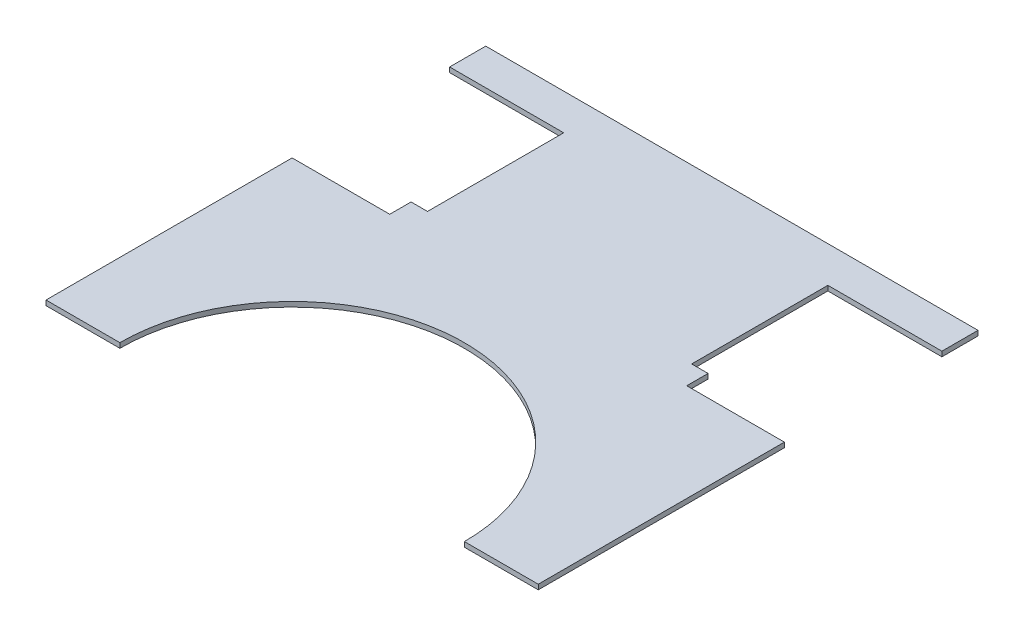
ISO-10303-21;
HEADER;
FILE_DESCRIPTION(('STEP AP214'),'2;1');
FILE_NAME('part.step','',(''),(''),'','','');
FILE_SCHEMA(('AUTOMOTIVE_DESIGN { 1 0 10303 214 1 1 1 1 }'));
ENDSEC;
DATA;
#1=APPLICATION_CONTEXT('core data for automotive mechanical design processes');
#2=APPLICATION_PROTOCOL_DEFINITION('international standard','automotive_design',2000,#1);
#3=PRODUCT_CONTEXT('',#1,'mechanical');
#4=PRODUCT('Part','Part','',(#3));
#5=PRODUCT_RELATED_PRODUCT_CATEGORY('part','',(#4));
#6=PRODUCT_DEFINITION_FORMATION('','',#4);
#7=PRODUCT_DEFINITION_CONTEXT('part definition',#1,'design');
#8=PRODUCT_DEFINITION('design','',#6,#7);
#9=PRODUCT_DEFINITION_SHAPE('','',#8);
#10=(LENGTH_UNIT() NAMED_UNIT(*) SI_UNIT(.MILLI.,.METRE.));
#11=(NAMED_UNIT(*) PLANE_ANGLE_UNIT() SI_UNIT($,.RADIAN.));
#12=(NAMED_UNIT(*) SI_UNIT($,.STERADIAN.) SOLID_ANGLE_UNIT());
#13=UNCERTAINTY_MEASURE_WITH_UNIT(LENGTH_MEASURE(1.E-05),#10,'distance_accuracy_value','');
#14=(GEOMETRIC_REPRESENTATION_CONTEXT(3) GLOBAL_UNCERTAINTY_ASSIGNED_CONTEXT((#13)) GLOBAL_UNIT_ASSIGNED_CONTEXT((#10,
#11,#12)) REPRESENTATION_CONTEXT('',''));
#15=CARTESIAN_POINT('',(0.,0.,0.));
#16=DIRECTION('',(0.,0.,1.));
#17=DIRECTION('',(1.,0.,0.));
#18=AXIS2_PLACEMENT_3D('',#15,#16,#17);
#19=CARTESIAN_POINT('',(-150.,3.,0.));
#20=DIRECTION('',(1.,0.,0.));
#21=DIRECTION('',(0.,0.,-1.));
#22=AXIS2_PLACEMENT_3D('',#19,#20,#21);
#23=PLANE('',#22);
#24=DIRECTION('',(0.,0.,1.));
#25=VECTOR('',#24,1.);
#26=CARTESIAN_POINT('',(-150.,0.,0.));
#27=LINE('',#26,#25);
#28=CARTESIAN_POINT('',(-150.,0.,0.));
#29=VERTEX_POINT('',#28);
#30=CARTESIAN_POINT('',(-150.,0.,22.));
#31=VERTEX_POINT('',#30);
#32=EDGE_CURVE('E187',#29,#31,#27,.T.);
#33=ORIENTED_EDGE('',*,*,#32,.T.);
#34=DIRECTION('',(0.,-1.,0.));
#35=VECTOR('',#34,1.);
#36=CARTESIAN_POINT('',(-150.,3.,22.));
#37=LINE('',#36,#35);
#38=CARTESIAN_POINT('',(-150.,3.,22.));
#39=VERTEX_POINT('',#38);
#40=EDGE_CURVE('E11',#39,#31,#37,.T.);
#41=ORIENTED_EDGE('',*,*,#40,.F.);
#42=DIRECTION('',(0.,0.,1.));
#43=VECTOR('',#42,1.);
#44=CARTESIAN_POINT('',(-150.,3.,0.));
#45=LINE('',#44,#43);
#46=CARTESIAN_POINT('',(-150.,3.,0.));
#47=VERTEX_POINT('',#46);
#48=EDGE_CURVE('E221',#47,#39,#45,.T.);
#49=ORIENTED_EDGE('',*,*,#48,.F.);
#50=DIRECTION('',(0.,-1.,0.));
#51=VECTOR('',#50,1.);
#52=CARTESIAN_POINT('',(-150.,3.,0.));
#53=LINE('',#52,#51);
#54=EDGE_CURVE('E183',#47,#29,#53,.T.);
#55=ORIENTED_EDGE('',*,*,#54,.T.);
#56=EDGE_LOOP('',(#33,#41,#49,#55));
#57=FACE_BOUND('',#56,.T.);
#58=ADVANCED_FACE('F31',(#57),#23,.F.);
#59=CARTESIAN_POINT('',(-150.,3.,22.));
#60=DIRECTION('',(0.,0.,-1.));
#61=DIRECTION('',(-1.,0.,0.));
#62=AXIS2_PLACEMENT_3D('',#59,#60,#61);
#63=PLANE('',#62);
#64=DIRECTION('',(1.,0.,0.));
#65=VECTOR('',#64,1.);
#66=CARTESIAN_POINT('',(-150.,0.,22.));
#67=LINE('',#66,#65);
#68=CARTESIAN_POINT('',(-80.5,0.,22.));
#69=VERTEX_POINT('',#68);
#70=EDGE_CURVE('E190',#31,#69,#67,.T.);
#71=ORIENTED_EDGE('',*,*,#70,.T.);
#72=DIRECTION('',(0.,-1.,0.));
#73=VECTOR('',#72,1.);
#74=CARTESIAN_POINT('',(-80.5,3.,22.));
#75=LINE('',#74,#73);
#76=CARTESIAN_POINT('',(-80.5,3.,22.));
#77=VERTEX_POINT('',#76);
#78=EDGE_CURVE('E39',#77,#69,#75,.T.);
#79=ORIENTED_EDGE('',*,*,#78,.F.);
#80=DIRECTION('',(1.,0.,0.));
#81=VECTOR('',#80,1.);
#82=CARTESIAN_POINT('',(-150.,3.,22.));
#83=LINE('',#82,#81);
#84=EDGE_CURVE('E120',#39,#77,#83,.T.);
#85=ORIENTED_EDGE('',*,*,#84,.F.);
#86=ORIENTED_EDGE('',*,*,#40,.T.);
#87=EDGE_LOOP('',(#71,#79,#85,#86));
#88=FACE_BOUND('',#87,.T.);
#89=ADVANCED_FACE('F329',(#88),#63,.F.);
#90=CARTESIAN_POINT('',(-80.5,3.,22.));
#91=DIRECTION('',(1.,0.,0.));
#92=DIRECTION('',(0.,0.,-1.));
#93=AXIS2_PLACEMENT_3D('',#90,#91,#92);
#94=PLANE('',#93);
#95=DIRECTION('',(0.,0.,1.));
#96=VECTOR('',#95,1.);
#97=CARTESIAN_POINT('',(-80.5,0.,22.));
#98=LINE('',#97,#96);
#99=CARTESIAN_POINT('',(-80.5,0.,105.));
#100=VERTEX_POINT('',#99);
#101=EDGE_CURVE('E192',#69,#100,#98,.T.);
#102=ORIENTED_EDGE('',*,*,#101,.T.);
#103=DIRECTION('',(0.,-1.,0.));
#104=VECTOR('',#103,1.);
#105=CARTESIAN_POINT('',(-80.5,3.,105.));
#106=LINE('',#105,#104);
#107=CARTESIAN_POINT('',(-80.5,3.,105.));
#108=VERTEX_POINT('',#107);
#109=EDGE_CURVE('E258',#108,#100,#106,.T.);
#110=ORIENTED_EDGE('',*,*,#109,.F.);
#111=DIRECTION('',(0.,0.,1.));
#112=VECTOR('',#111,1.);
#113=CARTESIAN_POINT('',(-80.5,3.,22.));
#114=LINE('',#113,#112);
#115=EDGE_CURVE('E266',#77,#108,#114,.T.);
#116=ORIENTED_EDGE('',*,*,#115,.F.);
#117=ORIENTED_EDGE('',*,*,#78,.T.);
#118=EDGE_LOOP('',(#102,#110,#116,#117));
#119=FACE_BOUND('',#118,.T.);
#120=ADVANCED_FACE('F264',(#119),#94,.F.);
#121=CARTESIAN_POINT('',(-80.5,3.,105.));
#122=DIRECTION('',(0.,0.,1.));
#123=DIRECTION('',(1.,0.,0.));
#124=AXIS2_PLACEMENT_3D('',#121,#122,#123);
#125=PLANE('',#124);
#126=DIRECTION('',(-1.,0.,0.));
#127=VECTOR('',#126,1.);
#128=CARTESIAN_POINT('',(-80.5,0.,105.));
#129=LINE('',#128,#127);
#130=CARTESIAN_POINT('',(-90.5,0.,105.));
#131=VERTEX_POINT('',#130);
#132=EDGE_CURVE('E194',#100,#131,#129,.T.);
#133=ORIENTED_EDGE('',*,*,#132,.T.);
#134=DIRECTION('',(0.,-1.,0.));
#135=VECTOR('',#134,1.);
#136=CARTESIAN_POINT('',(-90.5,3.,105.));
#137=LINE('',#136,#135);
#138=CARTESIAN_POINT('',(-90.5,3.,105.));
#139=VERTEX_POINT('',#138);
#140=EDGE_CURVE('E255',#139,#131,#137,.T.);
#141=ORIENTED_EDGE('',*,*,#140,.F.);
#142=DIRECTION('',(-1.,0.,0.));
#143=VECTOR('',#142,1.);
#144=CARTESIAN_POINT('',(-80.5,3.,105.));
#145=LINE('',#144,#143);
#146=EDGE_CURVE('E284',#108,#139,#145,.T.);
#147=ORIENTED_EDGE('',*,*,#146,.F.);
#148=ORIENTED_EDGE('',*,*,#109,.T.);
#149=EDGE_LOOP('',(#133,#141,#147,#148));
#150=FACE_BOUND('',#149,.T.);
#151=ADVANCED_FACE('F275',(#150),#125,.F.);
#152=CARTESIAN_POINT('',(-90.5,3.,105.));
#153=DIRECTION('',(1.,0.,0.));
#154=DIRECTION('',(0.,0.,-1.));
#155=AXIS2_PLACEMENT_3D('',#152,#153,#154);
#156=PLANE('',#155);
#157=DIRECTION('',(0.,0.,1.));
#158=VECTOR('',#157,1.);
#159=CARTESIAN_POINT('',(-90.5,0.,105.));
#160=LINE('',#159,#158);
#161=CARTESIAN_POINT('',(-90.5,0.,118.));
#162=VERTEX_POINT('',#161);
#163=EDGE_CURVE('E196',#131,#162,#160,.T.);
#164=ORIENTED_EDGE('',*,*,#163,.T.);
#165=DIRECTION('',(0.,-1.,0.));
#166=VECTOR('',#165,1.);
#167=CARTESIAN_POINT('',(-90.5,3.,118.));
#168=LINE('',#167,#166);
#169=CARTESIAN_POINT('',(-90.5,3.,118.));
#170=VERTEX_POINT('',#169);
#171=EDGE_CURVE('E252',#170,#162,#168,.T.);
#172=ORIENTED_EDGE('',*,*,#171,.F.);
#173=DIRECTION('',(0.,0.,1.));
#174=VECTOR('',#173,1.);
#175=CARTESIAN_POINT('',(-90.5,3.,105.));
#176=LINE('',#175,#174);
#177=EDGE_CURVE('E281',#139,#170,#176,.T.);
#178=ORIENTED_EDGE('',*,*,#177,.F.);
#179=ORIENTED_EDGE('',*,*,#140,.T.);
#180=EDGE_LOOP('',(#164,#172,#178,#179));
#181=FACE_BOUND('',#180,.T.);
#182=ADVANCED_FACE('F279',(#181),#156,.F.);
#183=CARTESIAN_POINT('',(-90.5,3.,118.));
#184=DIRECTION('',(0.,0.,1.));
#185=DIRECTION('',(1.,0.,0.));
#186=AXIS2_PLACEMENT_3D('',#183,#184,#185);
#187=PLANE('',#186);
#188=DIRECTION('',(-1.,0.,0.));
#189=VECTOR('',#188,1.);
#190=CARTESIAN_POINT('',(-90.5,0.,118.));
#191=LINE('',#190,#189);
#192=CARTESIAN_POINT('',(-150.,0.,118.));
#193=VERTEX_POINT('',#192);
#194=EDGE_CURVE('E198',#162,#193,#191,.T.);
#195=ORIENTED_EDGE('',*,*,#194,.T.);
#196=DIRECTION('',(0.,-1.,0.));
#197=VECTOR('',#196,1.);
#198=CARTESIAN_POINT('',(-150.,3.,118.));
#199=LINE('',#198,#197);
#200=CARTESIAN_POINT('',(-150.,3.,118.));
#201=VERTEX_POINT('',#200);
#202=EDGE_CURVE('E249',#201,#193,#199,.T.);
#203=ORIENTED_EDGE('',*,*,#202,.F.);
#204=DIRECTION('',(-1.,0.,0.));
#205=VECTOR('',#204,1.);
#206=CARTESIAN_POINT('',(-90.5,3.,118.));
#207=LINE('',#206,#205);
#208=EDGE_CURVE('E283',#170,#201,#207,.T.);
#209=ORIENTED_EDGE('',*,*,#208,.F.);
#210=ORIENTED_EDGE('',*,*,#171,.T.);
#211=EDGE_LOOP('',(#195,#203,#209,#210));
#212=FACE_BOUND('',#211,.T.);
#213=ADVANCED_FACE('F342',(#212),#187,.F.);
#214=CARTESIAN_POINT('',(-150.,3.,118.));
#215=DIRECTION('',(1.,0.,0.));
#216=DIRECTION('',(0.,0.,-1.));
#217=AXIS2_PLACEMENT_3D('',#214,#215,#216);
#218=PLANE('',#217);
#219=DIRECTION('',(0.,0.,1.));
#220=VECTOR('',#219,1.);
#221=CARTESIAN_POINT('',(-150.,0.,118.));
#222=LINE('',#221,#220);
#223=CARTESIAN_POINT('',(-150.,0.,268.));
#224=VERTEX_POINT('',#223);
#225=EDGE_CURVE('E200',#193,#224,#222,.T.);
#226=ORIENTED_EDGE('',*,*,#225,.T.);
#227=DIRECTION('',(0.,-1.,0.));
#228=VECTOR('',#227,1.);
#229=CARTESIAN_POINT('',(-150.,3.,268.));
#230=LINE('',#229,#228);
#231=CARTESIAN_POINT('',(-150.,3.,268.));
#232=VERTEX_POINT('',#231);
#233=EDGE_CURVE('E246',#232,#224,#230,.T.);
#234=ORIENTED_EDGE('',*,*,#233,.F.);
#235=DIRECTION('',(0.,0.,1.));
#236=VECTOR('',#235,1.);
#237=CARTESIAN_POINT('',(-150.,3.,118.));
#238=LINE('',#237,#236);
#239=EDGE_CURVE('E286',#201,#232,#238,.T.);
#240=ORIENTED_EDGE('',*,*,#239,.F.);
#241=ORIENTED_EDGE('',*,*,#202,.T.);
#242=EDGE_LOOP('',(#226,#234,#240,#241));
#243=FACE_BOUND('',#242,.T.);
#244=ADVANCED_FACE('F345',(#243),#218,.F.);
#245=CARTESIAN_POINT('',(-150.,3.,268.));
#246=DIRECTION('',(0.,0.,-1.));
#247=DIRECTION('',(-1.,0.,0.));
#248=AXIS2_PLACEMENT_3D('',#245,#246,#247);
#249=PLANE('',#248);
#250=DIRECTION('',(1.,0.,0.));
#251=VECTOR('',#250,1.);
#252=CARTESIAN_POINT('',(-150.,0.,268.));
#253=LINE('',#252,#251);
#254=CARTESIAN_POINT('',(-105.,0.,268.));
#255=VERTEX_POINT('',#254);
#256=EDGE_CURVE('E202',#224,#255,#253,.T.);
#257=ORIENTED_EDGE('',*,*,#256,.T.);
#258=DIRECTION('',(0.,-1.,0.));
#259=VECTOR('',#258,1.);
#260=CARTESIAN_POINT('',(-105.,3.,268.));
#261=LINE('',#260,#259);
#262=CARTESIAN_POINT('',(-105.,3.,268.));
#263=VERTEX_POINT('',#262);
#264=EDGE_CURVE('E243',#263,#255,#261,.T.);
#265=ORIENTED_EDGE('',*,*,#264,.F.);
#266=DIRECTION('',(1.,0.,0.));
#267=VECTOR('',#266,1.);
#268=CARTESIAN_POINT('',(-150.,3.,268.));
#269=LINE('',#268,#267);
#270=EDGE_CURVE('E292',#232,#263,#269,.T.);
#271=ORIENTED_EDGE('',*,*,#270,.F.);
#272=ORIENTED_EDGE('',*,*,#233,.T.);
#273=EDGE_LOOP('',(#257,#265,#271,#272));
#274=FACE_BOUND('',#273,.T.);
#275=ADVANCED_FACE('F349',(#274),#249,.F.);
#276=CARTESIAN_POINT('',(0.,3.,268.));
#277=DIRECTION('',(0.,-1.,0.));
#278=DIRECTION('',(0.,0.,-1.));
#279=AXIS2_PLACEMENT_3D('',#276,#277,#278);
#280=CYLINDRICAL_SURFACE('',#279,105.);
#281=CARTESIAN_POINT('',(0.,0.,268.));
#282=DIRECTION('',(0.,-1.,0.));
#283=DIRECTION('',(0.,0.,-1.));
#284=AXIS2_PLACEMENT_3D('',#281,#282,#283);
#285=CIRCLE('',#284,105.);
#286=CARTESIAN_POINT('',(105.,0.,268.));
#287=VERTEX_POINT('',#286);
#288=EDGE_CURVE('E204',#255,#287,#285,.T.);
#289=ORIENTED_EDGE('',*,*,#288,.T.);
#290=DIRECTION('',(0.,-1.,0.));
#291=VECTOR('',#290,1.);
#292=CARTESIAN_POINT('',(105.,3.,268.));
#293=LINE('',#292,#291);
#294=CARTESIAN_POINT('',(105.,3.,268.));
#295=VERTEX_POINT('',#294);
#296=EDGE_CURVE('E240',#295,#287,#293,.T.);
#297=ORIENTED_EDGE('',*,*,#296,.F.);
#298=CARTESIAN_POINT('',(0.,3.,268.));
#299=DIRECTION('',(0.,-1.,0.));
#300=DIRECTION('',(0.,0.,-1.));
#301=AXIS2_PLACEMENT_3D('',#298,#299,#300);
#302=CIRCLE('',#301,105.);
#303=EDGE_CURVE('E294',#263,#295,#302,.T.);
#304=ORIENTED_EDGE('',*,*,#303,.F.);
#305=ORIENTED_EDGE('',*,*,#264,.T.);
#306=EDGE_LOOP('',(#289,#297,#304,#305));
#307=FACE_BOUND('',#306,.T.);
#308=ADVANCED_FACE('F353',(#307),#280,.F.);
#309=CARTESIAN_POINT('',(150.,3.,268.));
#310=DIRECTION('',(0.,0.,-1.));
#311=DIRECTION('',(-1.,0.,0.));
#312=AXIS2_PLACEMENT_3D('',#309,#310,#311);
#313=PLANE('',#312);
#314=DIRECTION('',(1.,0.,0.));
#315=VECTOR('',#314,1.);
#316=CARTESIAN_POINT('',(150.,0.,268.));
#317=LINE('',#316,#315);
#318=CARTESIAN_POINT('',(150.,0.,268.));
#319=VERTEX_POINT('',#318);
#320=EDGE_CURVE('E206',#287,#319,#317,.T.);
#321=ORIENTED_EDGE('',*,*,#320,.T.);
#322=DIRECTION('',(0.,-1.,0.));
#323=VECTOR('',#322,1.);
#324=CARTESIAN_POINT('',(150.,3.,268.));
#325=LINE('',#324,#323);
#326=CARTESIAN_POINT('',(150.,3.,268.));
#327=VERTEX_POINT('',#326);
#328=EDGE_CURVE('E237',#327,#319,#325,.T.);
#329=ORIENTED_EDGE('',*,*,#328,.F.);
#330=DIRECTION('',(1.,0.,0.));
#331=VECTOR('',#330,1.);
#332=CARTESIAN_POINT('',(150.,3.,268.));
#333=LINE('',#332,#331);
#334=EDGE_CURVE('E296',#295,#327,#333,.T.);
#335=ORIENTED_EDGE('',*,*,#334,.F.);
#336=ORIENTED_EDGE('',*,*,#296,.T.);
#337=EDGE_LOOP('',(#321,#329,#335,#336));
#338=FACE_BOUND('',#337,.T.);
#339=ADVANCED_FACE('F357',(#338),#313,.F.);
#340=CARTESIAN_POINT('',(150.,3.,118.));
#341=DIRECTION('',(-1.,0.,0.));
#342=DIRECTION('',(0.,0.,1.));
#343=AXIS2_PLACEMENT_3D('',#340,#341,#342);
#344=PLANE('',#343);
#345=DIRECTION('',(0.,0.,-1.));
#346=VECTOR('',#345,1.);
#347=CARTESIAN_POINT('',(150.,0.,118.));
#348=LINE('',#347,#346);
#349=CARTESIAN_POINT('',(150.,0.,118.));
#350=VERTEX_POINT('',#349);
#351=EDGE_CURVE('E208',#319,#350,#348,.T.);
#352=ORIENTED_EDGE('',*,*,#351,.T.);
#353=DIRECTION('',(0.,-1.,0.));
#354=VECTOR('',#353,1.);
#355=CARTESIAN_POINT('',(150.,3.,118.));
#356=LINE('',#355,#354);
#357=CARTESIAN_POINT('',(150.,3.,118.));
#358=VERTEX_POINT('',#357);
#359=EDGE_CURVE('E234',#358,#350,#356,.T.);
#360=ORIENTED_EDGE('',*,*,#359,.F.);
#361=DIRECTION('',(0.,0.,-1.));
#362=VECTOR('',#361,1.);
#363=CARTESIAN_POINT('',(150.,3.,118.));
#364=LINE('',#363,#362);
#365=EDGE_CURVE('E298',#327,#358,#364,.T.);
#366=ORIENTED_EDGE('',*,*,#365,.F.);
#367=ORIENTED_EDGE('',*,*,#328,.T.);
#368=EDGE_LOOP('',(#352,#360,#366,#367));
#369=FACE_BOUND('',#368,.T.);
#370=ADVANCED_FACE('F361',(#369),#344,.F.);
#371=CARTESIAN_POINT('',(90.5,3.,118.));
#372=DIRECTION('',(0.,0.,1.));
#373=DIRECTION('',(1.,0.,0.));
#374=AXIS2_PLACEMENT_3D('',#371,#372,#373);
#375=PLANE('',#374);
#376=DIRECTION('',(-1.,0.,0.));
#377=VECTOR('',#376,1.);
#378=CARTESIAN_POINT('',(90.5,0.,118.));
#379=LINE('',#378,#377);
#380=CARTESIAN_POINT('',(90.5,0.,118.));
#381=VERTEX_POINT('',#380);
#382=EDGE_CURVE('E210',#350,#381,#379,.T.);
#383=ORIENTED_EDGE('',*,*,#382,.T.);
#384=DIRECTION('',(0.,-1.,0.));
#385=VECTOR('',#384,1.);
#386=CARTESIAN_POINT('',(90.5,3.,118.));
#387=LINE('',#386,#385);
#388=CARTESIAN_POINT('',(90.5,3.,118.));
#389=VERTEX_POINT('',#388);
#390=EDGE_CURVE('E231',#389,#381,#387,.T.);
#391=ORIENTED_EDGE('',*,*,#390,.F.);
#392=DIRECTION('',(-1.,0.,0.));
#393=VECTOR('',#392,1.);
#394=CARTESIAN_POINT('',(90.5,3.,118.));
#395=LINE('',#394,#393);
#396=EDGE_CURVE('E300',#358,#389,#395,.T.);
#397=ORIENTED_EDGE('',*,*,#396,.F.);
#398=ORIENTED_EDGE('',*,*,#359,.T.);
#399=EDGE_LOOP('',(#383,#391,#397,#398));
#400=FACE_BOUND('',#399,.T.);
#401=ADVANCED_FACE('F365',(#400),#375,.F.);
#402=CARTESIAN_POINT('',(90.5,3.,105.));
#403=DIRECTION('',(-1.,0.,0.));
#404=DIRECTION('',(0.,0.,1.));
#405=AXIS2_PLACEMENT_3D('',#402,#403,#404);
#406=PLANE('',#405);
#407=DIRECTION('',(0.,0.,-1.));
#408=VECTOR('',#407,1.);
#409=CARTESIAN_POINT('',(90.5,0.,105.));
#410=LINE('',#409,#408);
#411=CARTESIAN_POINT('',(90.5,0.,105.));
#412=VERTEX_POINT('',#411);
#413=EDGE_CURVE('E212',#381,#412,#410,.T.);
#414=ORIENTED_EDGE('',*,*,#413,.T.);
#415=DIRECTION('',(0.,-1.,0.));
#416=VECTOR('',#415,1.);
#417=CARTESIAN_POINT('',(90.5,3.,105.));
#418=LINE('',#417,#416);
#419=CARTESIAN_POINT('',(90.5,3.,105.));
#420=VERTEX_POINT('',#419);
#421=EDGE_CURVE('E228',#420,#412,#418,.T.);
#422=ORIENTED_EDGE('',*,*,#421,.F.);
#423=DIRECTION('',(0.,0.,-1.));
#424=VECTOR('',#423,1.);
#425=CARTESIAN_POINT('',(90.5,3.,105.));
#426=LINE('',#425,#424);
#427=EDGE_CURVE('E302',#389,#420,#426,.T.);
#428=ORIENTED_EDGE('',*,*,#427,.F.);
#429=ORIENTED_EDGE('',*,*,#390,.T.);
#430=EDGE_LOOP('',(#414,#422,#428,#429));
#431=FACE_BOUND('',#430,.T.);
#432=ADVANCED_FACE('F369',(#431),#406,.F.);
#433=CARTESIAN_POINT('',(80.5,3.,105.));
#434=DIRECTION('',(0.,0.,1.));
#435=DIRECTION('',(1.,0.,0.));
#436=AXIS2_PLACEMENT_3D('',#433,#434,#435);
#437=PLANE('',#436);
#438=DIRECTION('',(-1.,0.,0.));
#439=VECTOR('',#438,1.);
#440=CARTESIAN_POINT('',(80.5,0.,105.));
#441=LINE('',#440,#439);
#442=CARTESIAN_POINT('',(80.5,0.,105.));
#443=VERTEX_POINT('',#442);
#444=EDGE_CURVE('E214',#412,#443,#441,.T.);
#445=ORIENTED_EDGE('',*,*,#444,.T.);
#446=DIRECTION('',(0.,-1.,0.));
#447=VECTOR('',#446,1.);
#448=CARTESIAN_POINT('',(80.5,3.,105.));
#449=LINE('',#448,#447);
#450=CARTESIAN_POINT('',(80.5,3.,105.));
#451=VERTEX_POINT('',#450);
#452=EDGE_CURVE('E225',#451,#443,#449,.T.);
#453=ORIENTED_EDGE('',*,*,#452,.F.);
#454=DIRECTION('',(-1.,0.,0.));
#455=VECTOR('',#454,1.);
#456=CARTESIAN_POINT('',(80.5,3.,105.));
#457=LINE('',#456,#455);
#458=EDGE_CURVE('E304',#420,#451,#457,.T.);
#459=ORIENTED_EDGE('',*,*,#458,.F.);
#460=ORIENTED_EDGE('',*,*,#421,.T.);
#461=EDGE_LOOP('',(#445,#453,#459,#460));
#462=FACE_BOUND('',#461,.T.);
#463=ADVANCED_FACE('F310',(#462),#437,.F.);
#464=CARTESIAN_POINT('',(80.5,3.,22.));
#465=DIRECTION('',(-1.,0.,0.));
#466=DIRECTION('',(0.,0.,1.));
#467=AXIS2_PLACEMENT_3D('',#464,#465,#466);
#468=PLANE('',#467);
#469=DIRECTION('',(0.,0.,-1.));
#470=VECTOR('',#469,1.);
#471=CARTESIAN_POINT('',(80.5,0.,22.));
#472=LINE('',#471,#470);
#473=CARTESIAN_POINT('',(80.5,0.,22.));
#474=VERTEX_POINT('',#473);
#475=EDGE_CURVE('E216',#443,#474,#472,.T.);
#476=ORIENTED_EDGE('',*,*,#475,.T.);
#477=DIRECTION('',(0.,-1.,0.));
#478=VECTOR('',#477,1.);
#479=CARTESIAN_POINT('',(80.5,3.,22.));
#480=LINE('',#479,#478);
#481=CARTESIAN_POINT('',(80.5,3.,22.));
#482=VERTEX_POINT('',#481);
#483=EDGE_CURVE('E178',#482,#474,#480,.T.);
#484=ORIENTED_EDGE('',*,*,#483,.F.);
#485=DIRECTION('',(0.,0.,-1.));
#486=VECTOR('',#485,1.);
#487=CARTESIAN_POINT('',(80.5,3.,22.));
#488=LINE('',#487,#486);
#489=EDGE_CURVE('E169',#451,#482,#488,.T.);
#490=ORIENTED_EDGE('',*,*,#489,.F.);
#491=ORIENTED_EDGE('',*,*,#452,.T.);
#492=EDGE_LOOP('',(#476,#484,#490,#491));
#493=FACE_BOUND('',#492,.T.);
#494=ADVANCED_FACE('F314',(#493),#468,.F.);
#495=CARTESIAN_POINT('',(150.,3.,22.));
#496=DIRECTION('',(0.,0.,-1.));
#497=DIRECTION('',(-1.,0.,0.));
#498=AXIS2_PLACEMENT_3D('',#495,#496,#497);
#499=PLANE('',#498);
#500=DIRECTION('',(1.,0.,0.));
#501=VECTOR('',#500,1.);
#502=CARTESIAN_POINT('',(150.,0.,22.));
#503=LINE('',#502,#501);
#504=CARTESIAN_POINT('',(150.,0.,22.));
#505=VERTEX_POINT('',#504);
#506=EDGE_CURVE('E177',#474,#505,#503,.T.);
#507=ORIENTED_EDGE('',*,*,#506,.T.);
#508=DIRECTION('',(0.,-1.,0.));
#509=VECTOR('',#508,1.);
#510=CARTESIAN_POINT('',(150.,3.,22.));
#511=LINE('',#510,#509);
#512=CARTESIAN_POINT('',(150.,3.,22.));
#513=VERTEX_POINT('',#512);
#514=EDGE_CURVE('E174',#513,#505,#511,.T.);
#515=ORIENTED_EDGE('',*,*,#514,.F.);
#516=DIRECTION('',(1.,0.,0.));
#517=VECTOR('',#516,1.);
#518=CARTESIAN_POINT('',(150.,3.,22.));
#519=LINE('',#518,#517);
#520=EDGE_CURVE('E163',#482,#513,#519,.T.);
#521=ORIENTED_EDGE('',*,*,#520,.F.);
#522=ORIENTED_EDGE('',*,*,#483,.T.);
#523=EDGE_LOOP('',(#507,#515,#521,#522));
#524=FACE_BOUND('',#523,.T.);
#525=ADVANCED_FACE('F175',(#524),#499,.F.);
#526=CARTESIAN_POINT('',(150.,3.,0.));
#527=DIRECTION('',(-1.,0.,0.));
#528=DIRECTION('',(0.,0.,1.));
#529=AXIS2_PLACEMENT_3D('',#526,#527,#528);
#530=PLANE('',#529);
#531=DIRECTION('',(0.,0.,-1.));
#532=VECTOR('',#531,1.);
#533=CARTESIAN_POINT('',(150.,0.,0.));
#534=LINE('',#533,#532);
#535=CARTESIAN_POINT('',(150.,0.,0.));
#536=VERTEX_POINT('',#535);
#537=EDGE_CURVE('E106',#505,#536,#534,.T.);
#538=ORIENTED_EDGE('',*,*,#537,.T.);
#539=DIRECTION('',(0.,-1.,0.));
#540=VECTOR('',#539,1.);
#541=CARTESIAN_POINT('',(150.,3.,0.));
#542=LINE('',#541,#540);
#543=CARTESIAN_POINT('',(150.,3.,0.));
#544=VERTEX_POINT('',#543);
#545=EDGE_CURVE('E179',#544,#536,#542,.T.);
#546=ORIENTED_EDGE('',*,*,#545,.F.);
#547=DIRECTION('',(0.,0.,-1.));
#548=VECTOR('',#547,1.);
#549=CARTESIAN_POINT('',(150.,3.,0.));
#550=LINE('',#549,#548);
#551=EDGE_CURVE('E167',#513,#544,#550,.T.);
#552=ORIENTED_EDGE('',*,*,#551,.F.);
#553=ORIENTED_EDGE('',*,*,#514,.T.);
#554=EDGE_LOOP('',(#538,#546,#552,#553));
#555=FACE_BOUND('',#554,.T.);
#556=ADVANCED_FACE('F181',(#555),#530,.F.);
#557=CARTESIAN_POINT('',(150.,3.,0.));
#558=DIRECTION('',(0.,0.,1.));
#559=DIRECTION('',(1.,0.,0.));
#560=AXIS2_PLACEMENT_3D('',#557,#558,#559);
#561=PLANE('',#560);
#562=DIRECTION('',(-1.,0.,0.));
#563=VECTOR('',#562,1.);
#564=CARTESIAN_POINT('',(150.,0.,0.));
#565=LINE('',#564,#563);
#566=EDGE_CURVE('E112',#536,#29,#565,.T.);
#567=ORIENTED_EDGE('',*,*,#566,.T.);
#568=ORIENTED_EDGE('',*,*,#54,.F.);
#569=DIRECTION('',(-1.,0.,0.));
#570=VECTOR('',#569,1.);
#571=CARTESIAN_POINT('',(150.,3.,0.));
#572=LINE('',#571,#570);
#573=EDGE_CURVE('E47',#544,#47,#572,.T.);
#574=ORIENTED_EDGE('',*,*,#573,.F.);
#575=ORIENTED_EDGE('',*,*,#545,.T.);
#576=EDGE_LOOP('',(#567,#568,#574,#575));
#577=FACE_BOUND('',#576,.T.);
#578=ADVANCED_FACE('F318',(#577),#561,.F.);
#579=CARTESIAN_POINT('',(0.,3.,268.));
#580=DIRECTION('',(0.,-1.,0.));
#581=DIRECTION('',(0.,0.,-1.));
#582=AXIS2_PLACEMENT_3D('',#579,#580,#581);
#583=PLANE('',#582);
#584=ORIENTED_EDGE('',*,*,#48,.T.);
#585=ORIENTED_EDGE('',*,*,#84,.T.);
#586=ORIENTED_EDGE('',*,*,#115,.T.);
#587=ORIENTED_EDGE('',*,*,#146,.T.);
#588=ORIENTED_EDGE('',*,*,#177,.T.);
#589=ORIENTED_EDGE('',*,*,#208,.T.);
#590=ORIENTED_EDGE('',*,*,#239,.T.);
#591=ORIENTED_EDGE('',*,*,#270,.T.);
#592=ORIENTED_EDGE('',*,*,#303,.T.);
#593=ORIENTED_EDGE('',*,*,#334,.T.);
#594=ORIENTED_EDGE('',*,*,#365,.T.);
#595=ORIENTED_EDGE('',*,*,#396,.T.);
#596=ORIENTED_EDGE('',*,*,#427,.T.);
#597=ORIENTED_EDGE('',*,*,#458,.T.);
#598=ORIENTED_EDGE('',*,*,#489,.T.);
#599=ORIENTED_EDGE('',*,*,#520,.T.);
#600=ORIENTED_EDGE('',*,*,#551,.T.);
#601=ORIENTED_EDGE('',*,*,#573,.T.);
#602=EDGE_LOOP('',(#584,#585,#586,#587,#588,#589,#590,#591,#592,#593,#594,#595,#596,#597,#598,
#599,#600,#601));
#603=FACE_BOUND('',#602,.T.);
#604=ADVANCED_FACE('F165',(#603),#583,.F.);
#605=CARTESIAN_POINT('',(0.,0.,268.));
#606=DIRECTION('',(0.,-1.,0.));
#607=DIRECTION('',(0.,0.,-1.));
#608=AXIS2_PLACEMENT_3D('',#605,#606,#607);
#609=PLANE('',#608);
#610=ORIENTED_EDGE('',*,*,#32,.F.);
#611=ORIENTED_EDGE('',*,*,#566,.F.);
#612=ORIENTED_EDGE('',*,*,#537,.F.);
#613=ORIENTED_EDGE('',*,*,#506,.F.);
#614=ORIENTED_EDGE('',*,*,#475,.F.);
#615=ORIENTED_EDGE('',*,*,#444,.F.);
#616=ORIENTED_EDGE('',*,*,#413,.F.);
#617=ORIENTED_EDGE('',*,*,#382,.F.);
#618=ORIENTED_EDGE('',*,*,#351,.F.);
#619=ORIENTED_EDGE('',*,*,#320,.F.);
#620=ORIENTED_EDGE('',*,*,#288,.F.);
#621=ORIENTED_EDGE('',*,*,#256,.F.);
#622=ORIENTED_EDGE('',*,*,#225,.F.);
#623=ORIENTED_EDGE('',*,*,#194,.F.);
#624=ORIENTED_EDGE('',*,*,#163,.F.);
#625=ORIENTED_EDGE('',*,*,#132,.F.);
#626=ORIENTED_EDGE('',*,*,#101,.F.);
#627=ORIENTED_EDGE('',*,*,#70,.F.);
#628=EDGE_LOOP('',(#610,#611,#612,#613,#614,#615,#616,#617,#618,#619,#620,#621,#622,#623,#624,
#625,#626,#627));
#629=FACE_BOUND('',#628,.T.);
#630=ADVANCED_FACE('F270',(#629),#609,.T.);
#631=CLOSED_SHELL('',(#58,#89,#120,#151,#182,#213,#244,#275,#308,#339,#370,#401,#432,#463,#494,
#525,#556,#578,#604,#630));
#632=MANIFOLD_SOLID_BREP('B2',#631);
#633=ADVANCED_BREP_SHAPE_REPRESENTATION('',(#18,#632),#14);
#634=SHAPE_DEFINITION_REPRESENTATION(#9,#633);
ENDSEC;
END-ISO-10303-21;
